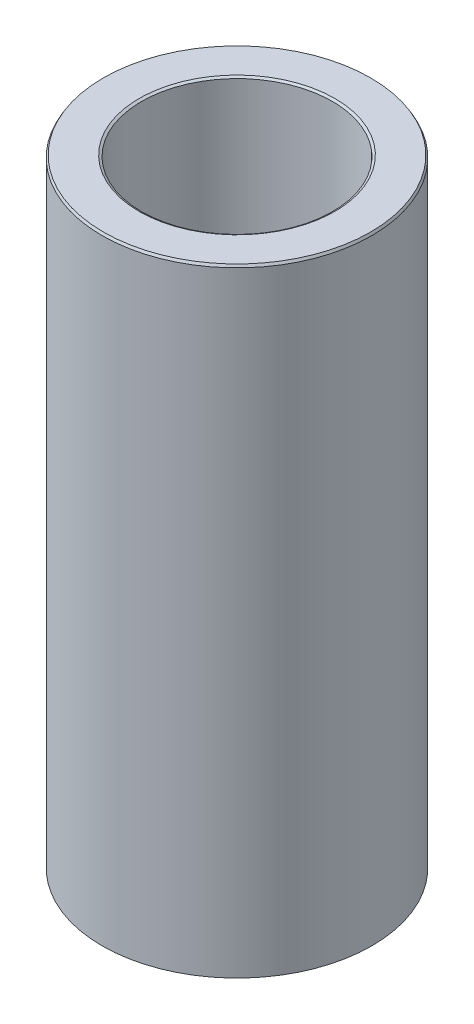
ISO-10303-21;
HEADER;
FILE_DESCRIPTION(('STEP AP214'),'2;1');
FILE_NAME('part.step','',(''),(''),'','','');
FILE_SCHEMA(('AUTOMOTIVE_DESIGN { 1 0 10303 214 1 1 1 1 }'));
ENDSEC;
DATA;
#1=APPLICATION_CONTEXT('core data for automotive mechanical design processes');
#2=APPLICATION_PROTOCOL_DEFINITION('international standard','automotive_design',2000,#1);
#3=PRODUCT_CONTEXT('',#1,'mechanical');
#4=PRODUCT('Part','Part','',(#3));
#5=PRODUCT_RELATED_PRODUCT_CATEGORY('part','',(#4));
#6=PRODUCT_DEFINITION_FORMATION('','',#4);
#7=PRODUCT_DEFINITION_CONTEXT('part definition',#1,'design');
#8=PRODUCT_DEFINITION('design','',#6,#7);
#9=PRODUCT_DEFINITION_SHAPE('','',#8);
#10=(LENGTH_UNIT() NAMED_UNIT(*) SI_UNIT(.MILLI.,.METRE.));
#11=(NAMED_UNIT(*) PLANE_ANGLE_UNIT() SI_UNIT($,.RADIAN.));
#12=(NAMED_UNIT(*) SI_UNIT($,.STERADIAN.) SOLID_ANGLE_UNIT());
#13=UNCERTAINTY_MEASURE_WITH_UNIT(LENGTH_MEASURE(1.E-05),#10,'distance_accuracy_value','');
#14=(GEOMETRIC_REPRESENTATION_CONTEXT(3) GLOBAL_UNCERTAINTY_ASSIGNED_CONTEXT((#13)) GLOBAL_UNIT_ASSIGNED_CONTEXT((#10,
#11,#12)) REPRESENTATION_CONTEXT('',''));
#15=CARTESIAN_POINT('',(0.,0.,0.));
#16=DIRECTION('',(0.,0.,1.));
#17=DIRECTION('',(1.,0.,0.));
#18=AXIS2_PLACEMENT_3D('',#15,#16,#17);
#19=CARTESIAN_POINT('',(0.,275.163872599054,0.));
#20=DIRECTION('',(0.,-1.,0.));
#21=DIRECTION('',(0.,0.,-1.));
#22=AXIS2_PLACEMENT_3D('',#19,#20,#21);
#23=CYLINDRICAL_SURFACE('',#22,60.);
#24=CARTESIAN_POINT('',(0.,0.608811274682985,0.));
#25=DIRECTION('',(0.,1.,0.));
#26=DIRECTION('',(0.,0.,1.));
#27=AXIS2_PLACEMENT_3D('',#24,#25,#26);
#28=CIRCLE('',#27,60.);
#29=CARTESIAN_POINT('',(0.,0.608811274682985,60.));
#30=VERTEX_POINT('',#29);
#31=EDGE_CURVE('E10',#30,#30,#28,.T.);
#32=ORIENTED_EDGE('',*,*,#31,.T.);
#33=EDGE_LOOP('',(#32));
#34=FACE_BOUND('',#33,.T.);
#35=CARTESIAN_POINT('',(0.,274.109380539082,0.));
#36=DIRECTION('',(0.,1.,0.));
#37=DIRECTION('',(0.,0.,1.));
#38=AXIS2_PLACEMENT_3D('',#35,#36,#37);
#39=CIRCLE('',#38,60.);
#40=CARTESIAN_POINT('',(0.,274.109380539082,60.));
#41=VERTEX_POINT('',#40);
#42=EDGE_CURVE('E50',#41,#41,#39,.F.);
#43=ORIENTED_EDGE('',*,*,#42,.T.);
#44=EDGE_LOOP('',(#43));
#45=FACE_BOUND('',#44,.T.);
#46=ADVANCED_FACE('F39',(#34,#45),#23,.T.);
#47=CARTESIAN_POINT('',(0.,275.163872599054,0.));
#48=DIRECTION('',(0.,1.,0.));
#49=DIRECTION('',(0.,0.,1.));
#50=AXIS2_PLACEMENT_3D('',#47,#48,#49);
#51=PLANE('',#50);
#52=CARTESIAN_POINT('',(0.,275.163872599054,0.));
#53=DIRECTION('',(0.,1.,0.));
#54=DIRECTION('',(0.,0.,1.));
#55=AXIS2_PLACEMENT_3D('',#52,#53,#54);
#56=CIRCLE('',#55,43.5100704161004);
#57=CARTESIAN_POINT('',(0.,275.163872599054,43.5100704161004));
#58=VERTEX_POINT('',#57);
#59=EDGE_CURVE('E58',#58,#58,#56,.F.);
#60=ORIENTED_EDGE('',*,*,#59,.T.);
#61=EDGE_LOOP('',(#60));
#62=FACE_BOUND('',#61,.T.);
#63=CARTESIAN_POINT('',(0.,275.163872599054,0.));
#64=DIRECTION('',(0.,1.,0.));
#65=DIRECTION('',(0.,0.,1.));
#66=AXIS2_PLACEMENT_3D('',#63,#64,#65);
#67=CIRCLE('',#66,59.391188725317);
#68=CARTESIAN_POINT('',(0.,275.163872599054,59.391188725317));
#69=VERTEX_POINT('',#68);
#70=EDGE_CURVE('E61',#69,#69,#67,.T.);
#71=ORIENTED_EDGE('',*,*,#70,.T.);
#72=EDGE_LOOP('',(#71));
#73=FACE_BOUND('',#72,.T.);
#74=ADVANCED_FACE('F88',(#62,#73),#51,.T.);
#75=CARTESIAN_POINT('',(0.,0.,0.));
#76=DIRECTION('',(0.,1.,0.));
#77=DIRECTION('',(0.,0.,1.));
#78=AXIS2_PLACEMENT_3D('',#75,#76,#77);
#79=PLANE('',#78);
#80=CARTESIAN_POINT('',(0.,0.,0.));
#81=DIRECTION('',(0.,1.,0.));
#82=DIRECTION('',(0.,0.,1.));
#83=AXIS2_PLACEMENT_3D('',#80,#81,#82);
#84=CIRCLE('',#83,43.0643896308118);
#85=CARTESIAN_POINT('',(0.,0.,43.0643896308118));
#86=VERTEX_POINT('',#85);
#87=EDGE_CURVE('E51',#86,#86,#84,.T.);
#88=ORIENTED_EDGE('',*,*,#87,.T.);
#89=EDGE_LOOP('',(#88));
#90=FACE_BOUND('',#89,.T.);
#91=CARTESIAN_POINT('',(0.,0.,0.));
#92=DIRECTION('',(0.,1.,0.));
#93=DIRECTION('',(0.,0.,1.));
#94=AXIS2_PLACEMENT_3D('',#91,#92,#93);
#95=CIRCLE('',#94,58.9455079400283);
#96=CARTESIAN_POINT('',(0.,0.,58.9455079400283));
#97=VERTEX_POINT('',#96);
#98=EDGE_CURVE('E54',#97,#97,#95,.F.);
#99=ORIENTED_EDGE('',*,*,#98,.T.);
#100=EDGE_LOOP('',(#99));
#101=FACE_BOUND('',#100,.T.);
#102=ADVANCED_FACE('F83',(#90,#101),#79,.F.);
#103=CARTESIAN_POINT('',(0.,275.163872599054,0.));
#104=DIRECTION('',(0.,-1.,0.));
#105=DIRECTION('',(0.,0.,-1.));
#106=AXIS2_PLACEMENT_3D('',#103,#104,#105);
#107=CYLINDRICAL_SURFACE('',#106,42.4555783561288);
#108=CARTESIAN_POINT('',(0.,274.555061324371,0.));
#109=DIRECTION('',(0.,1.,0.));
#110=DIRECTION('',(0.,0.,1.));
#111=AXIS2_PLACEMENT_3D('',#108,#109,#110);
#112=CIRCLE('',#111,42.4555783561288);
#113=CARTESIAN_POINT('',(0.,274.555061324371,42.4555783561288));
#114=VERTEX_POINT('',#113);
#115=EDGE_CURVE('E67',#114,#114,#112,.T.);
#116=ORIENTED_EDGE('',*,*,#115,.T.);
#117=EDGE_LOOP('',(#116));
#118=FACE_BOUND('',#117,.T.);
#119=CARTESIAN_POINT('',(0.,1.05449205997171,0.));
#120=DIRECTION('',(0.,1.,0.));
#121=DIRECTION('',(0.,0.,1.));
#122=AXIS2_PLACEMENT_3D('',#119,#120,#121);
#123=CIRCLE('',#122,42.4555783561288);
#124=CARTESIAN_POINT('',(0.,1.05449205997171,42.4555783561288));
#125=VERTEX_POINT('',#124);
#126=EDGE_CURVE('E69',#125,#125,#123,.F.);
#127=ORIENTED_EDGE('',*,*,#126,.T.);
#128=EDGE_LOOP('',(#127));
#129=FACE_BOUND('',#128,.T.);
#130=ADVANCED_FACE('F71',(#118,#129),#107,.F.);
#131=CARTESIAN_POINT('',(0.,274.555061324371,0.));
#132=DIRECTION('',(0.,1.,0.));
#133=DIRECTION('',(0.,0.,1.));
#134=AXIS2_PLACEMENT_3D('',#131,#132,#133);
#135=CONICAL_SURFACE('',#134,42.4555783561288,1.04719755119655);
#136=ORIENTED_EDGE('',*,*,#59,.F.);
#137=EDGE_LOOP('',(#136));
#138=FACE_BOUND('',#137,.T.);
#139=ORIENTED_EDGE('',*,*,#115,.F.);
#140=EDGE_LOOP('',(#139));
#141=FACE_BOUND('',#140,.T.);
#142=ADVANCED_FACE('F77',(#138,#141),#135,.F.);
#143=CARTESIAN_POINT('',(0.,0.,0.));
#144=DIRECTION('',(0.,-1.,0.));
#145=DIRECTION('',(0.,0.,-1.));
#146=AXIS2_PLACEMENT_3D('',#143,#144,#145);
#147=CONICAL_SURFACE('',#146,43.0643896308118,0.52359877559829);
#148=ORIENTED_EDGE('',*,*,#126,.F.);
#149=EDGE_LOOP('',(#148));
#150=FACE_BOUND('',#149,.T.);
#151=ORIENTED_EDGE('',*,*,#87,.F.);
#152=EDGE_LOOP('',(#151));
#153=FACE_BOUND('',#152,.T.);
#154=ADVANCED_FACE('F73',(#150,#153),#147,.F.);
#155=CARTESIAN_POINT('',(0.,0.608811274682985,0.));
#156=DIRECTION('',(0.,1.,0.));
#157=DIRECTION('',(0.,0.,1.));
#158=AXIS2_PLACEMENT_3D('',#155,#156,#157);
#159=CONICAL_SURFACE('',#158,60.,1.04719755119659);
#160=ORIENTED_EDGE('',*,*,#98,.F.);
#161=EDGE_LOOP('',(#160));
#162=FACE_BOUND('',#161,.T.);
#163=ORIENTED_EDGE('',*,*,#31,.F.);
#164=EDGE_LOOP('',(#163));
#165=FACE_BOUND('',#164,.T.);
#166=ADVANCED_FACE('F76',(#162,#165),#159,.T.);
#167=CARTESIAN_POINT('',(0.,275.163872599054,0.));
#168=DIRECTION('',(0.,-1.,0.));
#169=DIRECTION('',(0.,0.,-1.));
#170=AXIS2_PLACEMENT_3D('',#167,#168,#169);
#171=CONICAL_SURFACE('',#170,59.391188725317,0.523598775598295);
#172=ORIENTED_EDGE('',*,*,#42,.F.);
#173=EDGE_LOOP('',(#172));
#174=FACE_BOUND('',#173,.T.);
#175=ORIENTED_EDGE('',*,*,#70,.F.);
#176=EDGE_LOOP('',(#175));
#177=FACE_BOUND('',#176,.T.);
#178=ADVANCED_FACE('F45',(#174,#177),#171,.T.);
#179=CLOSED_SHELL('',(#46,#74,#102,#130,#142,#154,#166,#178));
#180=MANIFOLD_SOLID_BREP('B2',#179);
#181=ADVANCED_BREP_SHAPE_REPRESENTATION('',(#18,#180),#14);
#182=SHAPE_DEFINITION_REPRESENTATION(#9,#181);
ENDSEC;
END-ISO-10303-21;
